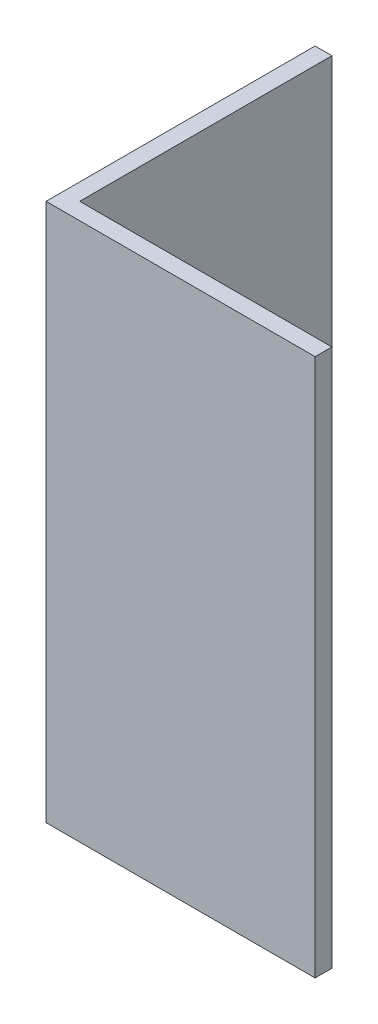
ISO-10303-21;
HEADER;
FILE_DESCRIPTION(('STEP AP214'),'2;1');
FILE_NAME('part.step','',(''),(''),'','','');
FILE_SCHEMA(('AUTOMOTIVE_DESIGN { 1 0 10303 214 1 1 1 1 }'));
ENDSEC;
DATA;
#1=APPLICATION_CONTEXT('core data for automotive mechanical design processes');
#2=APPLICATION_PROTOCOL_DEFINITION('international standard','automotive_design',2000,#1);
#3=PRODUCT_CONTEXT('',#1,'mechanical');
#4=PRODUCT('Part','Part','',(#3));
#5=PRODUCT_RELATED_PRODUCT_CATEGORY('part','',(#4));
#6=PRODUCT_DEFINITION_FORMATION('','',#4);
#7=PRODUCT_DEFINITION_CONTEXT('part definition',#1,'design');
#8=PRODUCT_DEFINITION('design','',#6,#7);
#9=PRODUCT_DEFINITION_SHAPE('','',#8);
#10=(LENGTH_UNIT() NAMED_UNIT(*) SI_UNIT(.MILLI.,.METRE.));
#11=(NAMED_UNIT(*) PLANE_ANGLE_UNIT() SI_UNIT($,.RADIAN.));
#12=(NAMED_UNIT(*) SI_UNIT($,.STERADIAN.) SOLID_ANGLE_UNIT());
#13=UNCERTAINTY_MEASURE_WITH_UNIT(LENGTH_MEASURE(1.E-05),#10,'distance_accuracy_value','');
#14=(GEOMETRIC_REPRESENTATION_CONTEXT(3) GLOBAL_UNCERTAINTY_ASSIGNED_CONTEXT((#13)) GLOBAL_UNIT_ASSIGNED_CONTEXT((#10,
#11,#12)) REPRESENTATION_CONTEXT('',''));
#15=CARTESIAN_POINT('',(0.,0.,0.));
#16=DIRECTION('',(0.,0.,1.));
#17=DIRECTION('',(1.,0.,0.));
#18=AXIS2_PLACEMENT_3D('',#15,#16,#17);
#19=CARTESIAN_POINT('',(25.4,50.8,0.));
#20=DIRECTION('',(0.,0.,-1.));
#21=DIRECTION('',(-1.,0.,0.));
#22=AXIS2_PLACEMENT_3D('',#19,#20,#21);
#23=PLANE('',#22);
#24=DIRECTION('',(1.,0.,0.));
#25=VECTOR('',#24,1.);
#26=CARTESIAN_POINT('',(25.4,0.,0.));
#27=LINE('',#26,#25);
#28=CARTESIAN_POINT('',(0.,0.,0.));
#29=VERTEX_POINT('',#28);
#30=CARTESIAN_POINT('',(25.4,0.,0.));
#31=VERTEX_POINT('',#30);
#32=EDGE_CURVE('E119',#29,#31,#27,.T.);
#33=ORIENTED_EDGE('',*,*,#32,.T.);
#34=DIRECTION('',(0.,-1.,0.));
#35=VECTOR('',#34,1.);
#36=CARTESIAN_POINT('',(25.4,50.8,0.));
#37=LINE('',#36,#35);
#38=CARTESIAN_POINT('',(25.4,50.8,0.));
#39=VERTEX_POINT('',#38);
#40=EDGE_CURVE('E11',#39,#31,#37,.T.);
#41=ORIENTED_EDGE('',*,*,#40,.F.);
#42=DIRECTION('',(1.,0.,0.));
#43=VECTOR('',#42,1.);
#44=CARTESIAN_POINT('',(25.4,50.8,0.));
#45=LINE('',#44,#43);
#46=CARTESIAN_POINT('',(0.,50.8,0.));
#47=VERTEX_POINT('',#46);
#48=EDGE_CURVE('E129',#47,#39,#45,.T.);
#49=ORIENTED_EDGE('',*,*,#48,.F.);
#50=DIRECTION('',(0.,-1.,0.));
#51=VECTOR('',#50,1.);
#52=CARTESIAN_POINT('',(0.,50.8,0.));
#53=LINE('',#52,#51);
#54=EDGE_CURVE('E115',#47,#29,#53,.T.);
#55=ORIENTED_EDGE('',*,*,#54,.T.);
#56=EDGE_LOOP('',(#33,#41,#49,#55));
#57=FACE_BOUND('',#56,.T.);
#58=ADVANCED_FACE('F35',(#57),#23,.F.);
#59=CARTESIAN_POINT('',(25.4,50.8,-1.5875));
#60=DIRECTION('',(-1.,0.,0.));
#61=DIRECTION('',(0.,0.,1.));
#62=AXIS2_PLACEMENT_3D('',#59,#60,#61);
#63=PLANE('',#62);
#64=DIRECTION('',(0.,0.,-1.));
#65=VECTOR('',#64,1.);
#66=CARTESIAN_POINT('',(25.4,0.,-1.5875));
#67=LINE('',#66,#65);
#68=CARTESIAN_POINT('',(25.4,0.,-1.5875));
#69=VERTEX_POINT('',#68);
#70=EDGE_CURVE('E122',#31,#69,#67,.T.);
#71=ORIENTED_EDGE('',*,*,#70,.T.);
#72=DIRECTION('',(0.,-1.,0.));
#73=VECTOR('',#72,1.);
#74=CARTESIAN_POINT('',(25.4,50.8,-1.5875));
#75=LINE('',#74,#73);
#76=CARTESIAN_POINT('',(25.4,50.8,-1.5875));
#77=VERTEX_POINT('',#76);
#78=EDGE_CURVE('E43',#77,#69,#75,.T.);
#79=ORIENTED_EDGE('',*,*,#78,.F.);
#80=DIRECTION('',(0.,0.,-1.));
#81=VECTOR('',#80,1.);
#82=CARTESIAN_POINT('',(25.4,50.8,-1.5875));
#83=LINE('',#82,#81);
#84=EDGE_CURVE('E88',#39,#77,#83,.T.);
#85=ORIENTED_EDGE('',*,*,#84,.F.);
#86=ORIENTED_EDGE('',*,*,#40,.T.);
#87=EDGE_LOOP('',(#71,#79,#85,#86));
#88=FACE_BOUND('',#87,.T.);
#89=ADVANCED_FACE('F153',(#88),#63,.F.);
#90=CARTESIAN_POINT('',(1.5875,50.8,-1.5875));
#91=DIRECTION('',(0.,0.,1.));
#92=DIRECTION('',(1.,0.,0.));
#93=AXIS2_PLACEMENT_3D('',#90,#91,#92);
#94=PLANE('',#93);
#95=DIRECTION('',(-1.,0.,0.));
#96=VECTOR('',#95,1.);
#97=CARTESIAN_POINT('',(1.5875,0.,-1.5875));
#98=LINE('',#97,#96);
#99=CARTESIAN_POINT('',(1.5875,0.,-1.5875));
#100=VERTEX_POINT('',#99);
#101=EDGE_CURVE('E124',#69,#100,#98,.T.);
#102=ORIENTED_EDGE('',*,*,#101,.T.);
#103=DIRECTION('',(0.,-1.,0.));
#104=VECTOR('',#103,1.);
#105=CARTESIAN_POINT('',(1.5875,50.8,-1.5875));
#106=LINE('',#105,#104);
#107=CARTESIAN_POINT('',(1.5875,50.8,-1.5875));
#108=VERTEX_POINT('',#107);
#109=EDGE_CURVE('E110',#108,#100,#106,.T.);
#110=ORIENTED_EDGE('',*,*,#109,.F.);
#111=DIRECTION('',(-1.,0.,0.));
#112=VECTOR('',#111,1.);
#113=CARTESIAN_POINT('',(1.5875,50.8,-1.5875));
#114=LINE('',#113,#112);
#115=EDGE_CURVE('E101',#77,#108,#114,.T.);
#116=ORIENTED_EDGE('',*,*,#115,.F.);
#117=ORIENTED_EDGE('',*,*,#78,.T.);
#118=EDGE_LOOP('',(#102,#110,#116,#117));
#119=FACE_BOUND('',#118,.T.);
#120=ADVANCED_FACE('F135',(#119),#94,.F.);
#121=CARTESIAN_POINT('',(1.5875,50.8,-25.4));
#122=DIRECTION('',(-1.,0.,0.));
#123=DIRECTION('',(0.,0.,1.));
#124=AXIS2_PLACEMENT_3D('',#121,#122,#123);
#125=PLANE('',#124);
#126=DIRECTION('',(0.,0.,-1.));
#127=VECTOR('',#126,1.);
#128=CARTESIAN_POINT('',(1.5875,0.,-25.4));
#129=LINE('',#128,#127);
#130=CARTESIAN_POINT('',(1.5875,0.,-25.4));
#131=VERTEX_POINT('',#130);
#132=EDGE_CURVE('E109',#100,#131,#129,.T.);
#133=ORIENTED_EDGE('',*,*,#132,.T.);
#134=DIRECTION('',(0.,-1.,0.));
#135=VECTOR('',#134,1.);
#136=CARTESIAN_POINT('',(1.5875,50.8,-25.4));
#137=LINE('',#136,#135);
#138=CARTESIAN_POINT('',(1.5875,50.8,-25.4));
#139=VERTEX_POINT('',#138);
#140=EDGE_CURVE('E106',#139,#131,#137,.T.);
#141=ORIENTED_EDGE('',*,*,#140,.F.);
#142=DIRECTION('',(0.,0.,-1.));
#143=VECTOR('',#142,1.);
#144=CARTESIAN_POINT('',(1.5875,50.8,-25.4));
#145=LINE('',#144,#143);
#146=EDGE_CURVE('E95',#108,#139,#145,.T.);
#147=ORIENTED_EDGE('',*,*,#146,.F.);
#148=ORIENTED_EDGE('',*,*,#109,.T.);
#149=EDGE_LOOP('',(#133,#141,#147,#148));
#150=FACE_BOUND('',#149,.T.);
#151=ADVANCED_FACE('F107',(#150),#125,.F.);
#152=CARTESIAN_POINT('',(0.,50.8,-25.4));
#153=DIRECTION('',(0.,0.,1.));
#154=DIRECTION('',(1.,0.,0.));
#155=AXIS2_PLACEMENT_3D('',#152,#153,#154);
#156=PLANE('',#155);
#157=DIRECTION('',(-1.,0.,0.));
#158=VECTOR('',#157,1.);
#159=CARTESIAN_POINT('',(0.,0.,-25.4));
#160=LINE('',#159,#158);
#161=CARTESIAN_POINT('',(0.,0.,-25.4));
#162=VERTEX_POINT('',#161);
#163=EDGE_CURVE('E74',#131,#162,#160,.T.);
#164=ORIENTED_EDGE('',*,*,#163,.T.);
#165=DIRECTION('',(0.,-1.,0.));
#166=VECTOR('',#165,1.);
#167=CARTESIAN_POINT('',(0.,50.8,-25.4));
#168=LINE('',#167,#166);
#169=CARTESIAN_POINT('',(0.,50.8,-25.4));
#170=VERTEX_POINT('',#169);
#171=EDGE_CURVE('E111',#170,#162,#168,.T.);
#172=ORIENTED_EDGE('',*,*,#171,.F.);
#173=DIRECTION('',(-1.,0.,0.));
#174=VECTOR('',#173,1.);
#175=CARTESIAN_POINT('',(0.,50.8,-25.4));
#176=LINE('',#175,#174);
#177=EDGE_CURVE('E99',#139,#170,#176,.T.);
#178=ORIENTED_EDGE('',*,*,#177,.F.);
#179=ORIENTED_EDGE('',*,*,#140,.T.);
#180=EDGE_LOOP('',(#164,#172,#178,#179));
#181=FACE_BOUND('',#180,.T.);
#182=ADVANCED_FACE('F113',(#181),#156,.F.);
#183=CARTESIAN_POINT('',(0.,50.8,0.));
#184=DIRECTION('',(1.,0.,0.));
#185=DIRECTION('',(0.,0.,-1.));
#186=AXIS2_PLACEMENT_3D('',#183,#184,#185);
#187=PLANE('',#186);
#188=DIRECTION('',(0.,0.,1.));
#189=VECTOR('',#188,1.);
#190=CARTESIAN_POINT('',(0.,0.,0.));
#191=LINE('',#190,#189);
#192=EDGE_CURVE('E80',#162,#29,#191,.T.);
#193=ORIENTED_EDGE('',*,*,#192,.T.);
#194=ORIENTED_EDGE('',*,*,#54,.F.);
#195=DIRECTION('',(0.,0.,1.));
#196=VECTOR('',#195,1.);
#197=CARTESIAN_POINT('',(0.,50.8,0.));
#198=LINE('',#197,#196);
#199=EDGE_CURVE('E51',#170,#47,#198,.T.);
#200=ORIENTED_EDGE('',*,*,#199,.F.);
#201=ORIENTED_EDGE('',*,*,#171,.T.);
#202=EDGE_LOOP('',(#193,#194,#200,#201));
#203=FACE_BOUND('',#202,.T.);
#204=ADVANCED_FACE('F142',(#203),#187,.F.);
#205=CARTESIAN_POINT('',(0.,50.8,0.));
#206=DIRECTION('',(0.,-1.,0.));
#207=DIRECTION('',(0.,0.,-1.));
#208=AXIS2_PLACEMENT_3D('',#205,#206,#207);
#209=PLANE('',#208);
#210=ORIENTED_EDGE('',*,*,#48,.T.);
#211=ORIENTED_EDGE('',*,*,#84,.T.);
#212=ORIENTED_EDGE('',*,*,#115,.T.);
#213=ORIENTED_EDGE('',*,*,#146,.T.);
#214=ORIENTED_EDGE('',*,*,#177,.T.);
#215=ORIENTED_EDGE('',*,*,#199,.T.);
#216=EDGE_LOOP('',(#210,#211,#212,#213,#214,#215));
#217=FACE_BOUND('',#216,.T.);
#218=ADVANCED_FACE('F97',(#217),#209,.F.);
#219=CARTESIAN_POINT('',(0.,0.,0.));
#220=DIRECTION('',(0.,-1.,0.));
#221=DIRECTION('',(0.,0.,-1.));
#222=AXIS2_PLACEMENT_3D('',#219,#220,#221);
#223=PLANE('',#222);
#224=ORIENTED_EDGE('',*,*,#32,.F.);
#225=ORIENTED_EDGE('',*,*,#192,.F.);
#226=ORIENTED_EDGE('',*,*,#163,.F.);
#227=ORIENTED_EDGE('',*,*,#132,.F.);
#228=ORIENTED_EDGE('',*,*,#101,.F.);
#229=ORIENTED_EDGE('',*,*,#70,.F.);
#230=EDGE_LOOP('',(#224,#225,#226,#227,#228,#229));
#231=FACE_BOUND('',#230,.T.);
#232=ADVANCED_FACE('F138',(#231),#223,.T.);
#233=CLOSED_SHELL('',(#58,#89,#120,#151,#182,#204,#218,#232));
#234=MANIFOLD_SOLID_BREP('B2',#233);
#235=ADVANCED_BREP_SHAPE_REPRESENTATION('',(#18,#234),#14);
#236=SHAPE_DEFINITION_REPRESENTATION(#9,#235);
ENDSEC;
END-ISO-10303-21;
